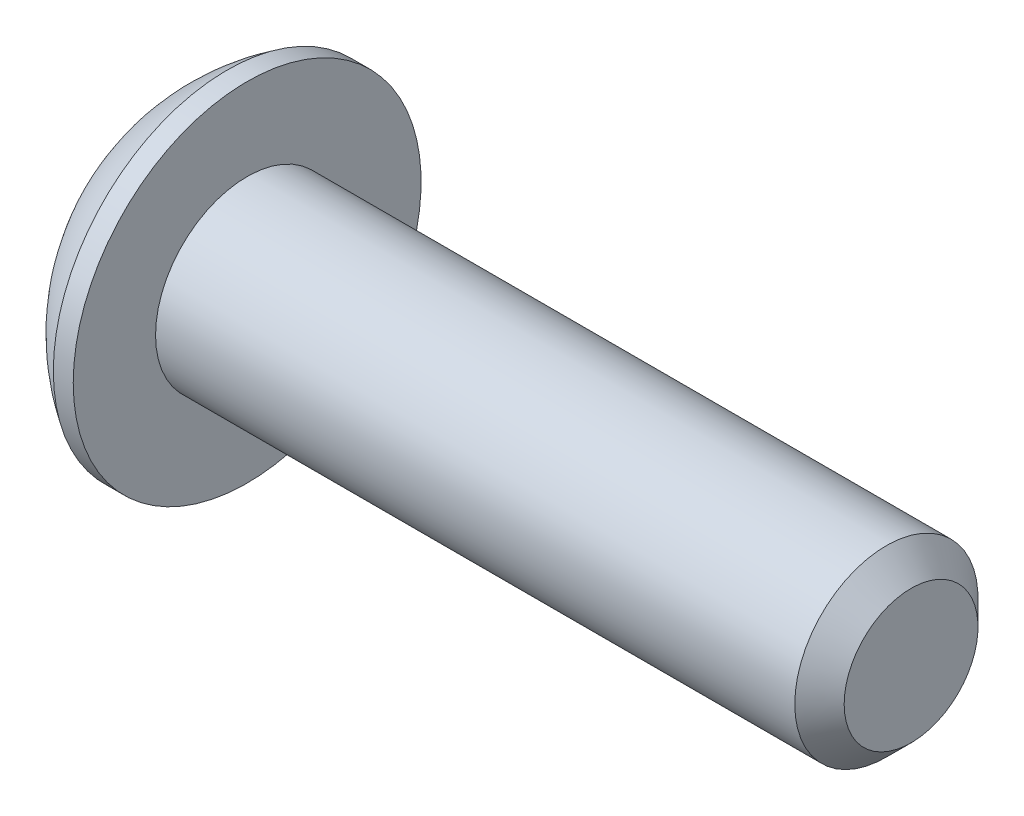
ISO-10303-21;
HEADER;
FILE_DESCRIPTION(('STEP AP214'),'2;1');
FILE_NAME('part.step','',(''),(''),'','','');
FILE_SCHEMA(('AUTOMOTIVE_DESIGN { 1 0 10303 214 1 1 1 1 }'));
ENDSEC;
DATA;
#1=APPLICATION_CONTEXT('core data for automotive mechanical design processes');
#2=APPLICATION_PROTOCOL_DEFINITION('international standard','automotive_design',2000,#1);
#3=PRODUCT_CONTEXT('',#1,'mechanical');
#4=PRODUCT('Part','Part','',(#3));
#5=PRODUCT_RELATED_PRODUCT_CATEGORY('part','',(#4));
#6=PRODUCT_DEFINITION_FORMATION('','',#4);
#7=PRODUCT_DEFINITION_CONTEXT('part definition',#1,'design');
#8=PRODUCT_DEFINITION('design','',#6,#7);
#9=PRODUCT_DEFINITION_SHAPE('','',#8);
#10=(LENGTH_UNIT() NAMED_UNIT(*) SI_UNIT(.MILLI.,.METRE.));
#11=(NAMED_UNIT(*) PLANE_ANGLE_UNIT() SI_UNIT($,.RADIAN.));
#12=(NAMED_UNIT(*) SI_UNIT($,.STERADIAN.) SOLID_ANGLE_UNIT());
#13=UNCERTAINTY_MEASURE_WITH_UNIT(LENGTH_MEASURE(1.E-05),#10,'distance_accuracy_value','');
#14=(GEOMETRIC_REPRESENTATION_CONTEXT(3) GLOBAL_UNCERTAINTY_ASSIGNED_CONTEXT((#13)) GLOBAL_UNIT_ASSIGNED_CONTEXT((#10,
#11,#12)) REPRESENTATION_CONTEXT('',''));
#15=CARTESIAN_POINT('',(0.,0.,0.));
#16=DIRECTION('',(0.,0.,1.));
#17=DIRECTION('',(1.,0.,0.));
#18=AXIS2_PLACEMENT_3D('',#15,#16,#17);
#19=CARTESIAN_POINT('',(0.,0.,0.));
#20=DIRECTION('',(-1.,0.,0.));
#21=DIRECTION('',(0.,0.,1.));
#22=AXIS2_PLACEMENT_3D('',#19,#20,#21);
#23=PLANE('',#22);
#24=CARTESIAN_POINT('',(0.,0.,0.));
#25=DIRECTION('',(-1.,0.,0.));
#26=DIRECTION('',(0.,0.,1.));
#27=AXIS2_PLACEMENT_3D('',#24,#25,#26);
#28=CIRCLE('',#27,1.6637);
#29=CARTESIAN_POINT('',(0.,0.,1.6637));
#30=VERTEX_POINT('',#29);
#31=EDGE_CURVE('E11',#30,#30,#28,.T.);
#32=ORIENTED_EDGE('',*,*,#31,.T.);
#33=EDGE_LOOP('',(#32));
#34=FACE_BOUND('',#33,.T.);
#35=DIRECTION('',(0.,-1.,0.));
#36=VECTOR('',#35,1.);
#37=CARTESIAN_POINT('',(0.,-0.571923176659242,0.9906));
#38=LINE('',#37,#36);
#39=CARTESIAN_POINT('',(0.,0.571923176659244,0.9906));
#40=VERTEX_POINT('',#39);
#41=CARTESIAN_POINT('',(0.,-0.571923176659242,0.9906));
#42=VERTEX_POINT('',#41);
#43=EDGE_CURVE('E44',#40,#42,#38,.T.);
#44=ORIENTED_EDGE('',*,*,#43,.T.);
#45=DIRECTION('',(0.,-0.5,-0.866025403784439));
#46=VECTOR('',#45,1.);
#47=CARTESIAN_POINT('',(0.,-1.14384635331849,0.));
#48=LINE('',#47,#46);
#49=CARTESIAN_POINT('',(0.,-1.14384635331849,0.));
#50=VERTEX_POINT('',#49);
#51=EDGE_CURVE('E365',#42,#50,#48,.T.);
#52=ORIENTED_EDGE('',*,*,#51,.T.);
#53=DIRECTION('',(0.,0.5,-0.866025403784439));
#54=VECTOR('',#53,1.);
#55=CARTESIAN_POINT('',(0.,-0.571923176659242,-0.9906));
#56=LINE('',#55,#54);
#57=CARTESIAN_POINT('',(0.,-0.571923176659242,-0.9906));
#58=VERTEX_POINT('',#57);
#59=EDGE_CURVE('E129',#50,#58,#56,.T.);
#60=ORIENTED_EDGE('',*,*,#59,.T.);
#61=DIRECTION('',(0.,1.,0.));
#62=VECTOR('',#61,1.);
#63=CARTESIAN_POINT('',(0.,0.571923176659244,-0.9906));
#64=LINE('',#63,#62);
#65=CARTESIAN_POINT('',(0.,0.571923176659244,-0.9906));
#66=VERTEX_POINT('',#65);
#67=EDGE_CURVE('E368',#58,#66,#64,.T.);
#68=ORIENTED_EDGE('',*,*,#67,.T.);
#69=DIRECTION('',(0.,0.5,0.866025403784439));
#70=VECTOR('',#69,1.);
#71=CARTESIAN_POINT('',(0.,1.14384635331849,0.));
#72=LINE('',#71,#70);
#73=CARTESIAN_POINT('',(0.,1.14384635331849,0.));
#74=VERTEX_POINT('',#73);
#75=EDGE_CURVE('E370',#66,#74,#72,.T.);
#76=ORIENTED_EDGE('',*,*,#75,.T.);
#77=DIRECTION('',(0.,-0.5,0.866025403784439));
#78=VECTOR('',#77,1.);
#79=CARTESIAN_POINT('',(0.,0.571923176659244,0.9906));
#80=LINE('',#79,#78);
#81=EDGE_CURVE('E372',#74,#40,#80,.T.);
#82=ORIENTED_EDGE('',*,*,#81,.T.);
#83=EDGE_LOOP('',(#44,#52,#60,#68,#76,#82));
#84=FACE_BOUND('',#83,.T.);
#85=ADVANCED_FACE('F30',(#34,#84),#23,.T.);
#86=CARTESIAN_POINT('',(3.55485043103449,0.,0.));
#87=DIRECTION('',(-1.,0.,0.));
#88=DIRECTION('',(0.,1.,0.));
#89=AXIS2_PLACEMENT_3D('',#86,#87,#88);
#90=SPHERICAL_SURFACE('',#89,3.92490245445999);
#91=CARTESIAN_POINT('',(1.4732,0.,0.));
#92=DIRECTION('',(-1.,0.,0.));
#93=DIRECTION('',(0.,0.,1.));
#94=AXIS2_PLACEMENT_3D('',#91,#92,#93);
#95=CIRCLE('',#94,3.3274);
#96=CARTESIAN_POINT('',(1.4732,0.,3.3274));
#97=VERTEX_POINT('',#96);
#98=EDGE_CURVE('E37',#97,#97,#95,.T.);
#99=ORIENTED_EDGE('',*,*,#98,.T.);
#100=EDGE_LOOP('',(#99));
#101=FACE_BOUND('',#100,.T.);
#102=ORIENTED_EDGE('',*,*,#31,.F.);
#103=EDGE_LOOP('',(#102));
#104=FACE_BOUND('',#103,.T.);
#105=ADVANCED_FACE('F156',(#101,#104),#90,.T.);
#106=CARTESIAN_POINT('',(0.,0.,0.));
#107=DIRECTION('',(-1.,0.,0.));
#108=DIRECTION('',(0.,0.,1.));
#109=AXIS2_PLACEMENT_3D('',#106,#107,#108);
#110=CYLINDRICAL_SURFACE('',#109,3.3274);
#111=ORIENTED_EDGE('',*,*,#98,.F.);
#112=EDGE_LOOP('',(#111));
#113=FACE_BOUND('',#112,.T.);
#114=CARTESIAN_POINT('',(1.8542,0.,0.));
#115=DIRECTION('',(-1.,0.,0.));
#116=DIRECTION('',(0.,0.,1.));
#117=AXIS2_PLACEMENT_3D('',#114,#115,#116);
#118=CIRCLE('',#117,3.3274);
#119=CARTESIAN_POINT('',(1.8542,0.,3.3274));
#120=VERTEX_POINT('',#119);
#121=EDGE_CURVE('E151',#120,#120,#118,.T.);
#122=ORIENTED_EDGE('',*,*,#121,.T.);
#123=EDGE_LOOP('',(#122));
#124=FACE_BOUND('',#123,.T.);
#125=ADVANCED_FACE('F159',(#113,#124),#110,.T.);
#126=CARTESIAN_POINT('',(1.8542,1.7526,0.));
#127=DIRECTION('',(-1.,0.,0.));
#128=DIRECTION('',(0.,0.,1.));
#129=AXIS2_PLACEMENT_3D('',#126,#127,#128);
#130=PLANE('',#129);
#131=ORIENTED_EDGE('',*,*,#121,.F.);
#132=EDGE_LOOP('',(#131));
#133=FACE_BOUND('',#132,.T.);
#134=CARTESIAN_POINT('',(1.8542,0.,0.));
#135=DIRECTION('',(-1.,0.,0.));
#136=DIRECTION('',(0.,0.,1.));
#137=AXIS2_PLACEMENT_3D('',#134,#135,#136);
#138=CIRCLE('',#137,1.7526);
#139=CARTESIAN_POINT('',(1.8542,0.,1.7526));
#140=VERTEX_POINT('',#139);
#141=EDGE_CURVE('E148',#140,#140,#138,.T.);
#142=ORIENTED_EDGE('',*,*,#141,.T.);
#143=EDGE_LOOP('',(#142));
#144=FACE_BOUND('',#143,.T.);
#145=ADVANCED_FACE('F162',(#133,#144),#130,.F.);
#146=CARTESIAN_POINT('',(0.,0.,0.));
#147=DIRECTION('',(-1.,0.,0.));
#148=DIRECTION('',(0.,0.,1.));
#149=AXIS2_PLACEMENT_3D('',#146,#147,#148);
#150=CYLINDRICAL_SURFACE('',#149,1.7526);
#151=ORIENTED_EDGE('',*,*,#141,.F.);
#152=EDGE_LOOP('',(#151));
#153=FACE_BOUND('',#152,.T.);
#154=CARTESIAN_POINT('',(14.08176,0.,0.));
#155=DIRECTION('',(-1.,0.,0.));
#156=DIRECTION('',(0.,0.,1.));
#157=AXIS2_PLACEMENT_3D('',#154,#155,#156);
#158=CIRCLE('',#157,1.7526);
#159=CARTESIAN_POINT('',(14.08176,0.,1.7526));
#160=VERTEX_POINT('',#159);
#161=EDGE_CURVE('E145',#160,#160,#158,.T.);
#162=ORIENTED_EDGE('',*,*,#161,.T.);
#163=EDGE_LOOP('',(#162));
#164=FACE_BOUND('',#163,.T.);
#165=ADVANCED_FACE('F168',(#153,#164),#150,.T.);
#166=CARTESIAN_POINT('',(14.5542,0.,0.));
#167=DIRECTION('',(-1.,0.,0.));
#168=DIRECTION('',(0.,0.,1.));
#169=AXIS2_PLACEMENT_3D('',#166,#167,#168);
#170=CONICAL_SURFACE('',#169,1.28016,0.785398163397441);
#171=ORIENTED_EDGE('',*,*,#161,.F.);
#172=EDGE_LOOP('',(#171));
#173=FACE_BOUND('',#172,.T.);
#174=CARTESIAN_POINT('',(14.5542,0.,0.));
#175=DIRECTION('',(-1.,0.,0.));
#176=DIRECTION('',(0.,0.,1.));
#177=AXIS2_PLACEMENT_3D('',#174,#175,#176);
#178=CIRCLE('',#177,1.28016);
#179=CARTESIAN_POINT('',(14.5542,0.,1.28016));
#180=VERTEX_POINT('',#179);
#181=EDGE_CURVE('E141',#180,#180,#178,.T.);
#182=ORIENTED_EDGE('',*,*,#181,.T.);
#183=EDGE_LOOP('',(#182));
#184=FACE_BOUND('',#183,.T.);
#185=ADVANCED_FACE('F174',(#173,#184),#170,.T.);
#186=CARTESIAN_POINT('',(14.5542,0.,0.));
#187=DIRECTION('',(-1.,0.,0.));
#188=DIRECTION('',(0.,0.,1.));
#189=AXIS2_PLACEMENT_3D('',#186,#187,#188);
#190=PLANE('',#189);
#191=ORIENTED_EDGE('',*,*,#181,.F.);
#192=EDGE_LOOP('',(#191));
#193=FACE_BOUND('',#192,.T.);
#194=ADVANCED_FACE('F180',(#193),#190,.F.);
#195=CARTESIAN_POINT('',(1.1176,-1.14384635331849,0.));
#196=DIRECTION('',(0.,0.866025403784439,-0.5));
#197=DIRECTION('',(0.,0.5,0.866025403784439));
#198=AXIS2_PLACEMENT_3D('',#195,#196,#197);
#199=PLANE('',#198);
#200=DIRECTION('',(0.,-0.5,-0.866025403784439));
#201=VECTOR('',#200,1.);
#202=CARTESIAN_POINT('',(1.1176,-1.14384635331849,0.));
#203=LINE('',#202,#201);
#204=CARTESIAN_POINT('',(1.1176,-0.571923176659242,0.9906));
#205=VERTEX_POINT('',#204);
#206=CARTESIAN_POINT('',(1.1176,-0.857884764988864,0.495299999999999));
#207=VERTEX_POINT('',#206);
#208=EDGE_CURVE('E112',#205,#207,#203,.T.);
#209=ORIENTED_EDGE('',*,*,#208,.T.);
#210=CARTESIAN_POINT('',(1.1176,-1.14384635331849,0.));
#211=VERTEX_POINT('',#210);
#212=EDGE_CURVE('E105',#207,#211,#203,.T.);
#213=ORIENTED_EDGE('',*,*,#212,.T.);
#214=DIRECTION('',(-1.,0.,0.));
#215=VECTOR('',#214,1.);
#216=CARTESIAN_POINT('',(1.1176,-1.14384635331849,0.));
#217=LINE('',#216,#215);
#218=EDGE_CURVE('E109',#211,#50,#217,.T.);
#219=ORIENTED_EDGE('',*,*,#218,.T.);
#220=ORIENTED_EDGE('',*,*,#51,.F.);
#221=DIRECTION('',(-1.,0.,0.));
#222=VECTOR('',#221,1.);
#223=CARTESIAN_POINT('',(1.1176,-0.571923176659242,0.9906));
#224=LINE('',#223,#222);
#225=EDGE_CURVE('E364',#205,#42,#224,.T.);
#226=ORIENTED_EDGE('',*,*,#225,.F.);
#227=EDGE_LOOP('',(#209,#213,#219,#220,#226));
#228=FACE_BOUND('',#227,.T.);
#229=ADVANCED_FACE('F107',(#228),#199,.T.);
#230=CARTESIAN_POINT('',(1.1176,-0.571923176659242,-0.9906));
#231=DIRECTION('',(0.,0.866025403784439,0.5));
#232=DIRECTION('',(0.,-0.5,0.866025403784439));
#233=AXIS2_PLACEMENT_3D('',#230,#231,#232);
#234=PLANE('',#233);
#235=DIRECTION('',(0.,0.5,-0.866025403784439));
#236=VECTOR('',#235,1.);
#237=CARTESIAN_POINT('',(1.1176,-0.571923176659242,-0.9906));
#238=LINE('',#237,#236);
#239=CARTESIAN_POINT('',(1.1176,-0.857884764988864,-0.495299999999999));
#240=VERTEX_POINT('',#239);
#241=EDGE_CURVE('E117',#211,#240,#238,.T.);
#242=ORIENTED_EDGE('',*,*,#241,.T.);
#243=CARTESIAN_POINT('',(1.1176,-0.571923176659242,-0.9906));
#244=VERTEX_POINT('',#243);
#245=EDGE_CURVE('E124',#240,#244,#238,.T.);
#246=ORIENTED_EDGE('',*,*,#245,.T.);
#247=DIRECTION('',(-1.,0.,0.));
#248=VECTOR('',#247,1.);
#249=CARTESIAN_POINT('',(1.1176,-0.571923176659242,-0.9906));
#250=LINE('',#249,#248);
#251=EDGE_CURVE('E131',#244,#58,#250,.T.);
#252=ORIENTED_EDGE('',*,*,#251,.T.);
#253=ORIENTED_EDGE('',*,*,#59,.F.);
#254=ORIENTED_EDGE('',*,*,#218,.F.);
#255=EDGE_LOOP('',(#242,#246,#252,#253,#254));
#256=FACE_BOUND('',#255,.T.);
#257=ADVANCED_FACE('F127',(#256),#234,.T.);
#258=CARTESIAN_POINT('',(1.1176,0.571923176659244,-0.9906));
#259=DIRECTION('',(0.,0.,1.));
#260=DIRECTION('',(1.,0.,0.));
#261=AXIS2_PLACEMENT_3D('',#258,#259,#260);
#262=PLANE('',#261);
#263=DIRECTION('',(0.,1.,0.));
#264=VECTOR('',#263,1.);
#265=CARTESIAN_POINT('',(1.1176,0.571923176659244,-0.9906));
#266=LINE('',#265,#264);
#267=CARTESIAN_POINT('',(1.1176,0.,-0.9906));
#268=VERTEX_POINT('',#267);
#269=EDGE_CURVE('E389',#244,#268,#266,.T.);
#270=ORIENTED_EDGE('',*,*,#269,.T.);
#271=CARTESIAN_POINT('',(1.1176,0.571923176659244,-0.9906));
#272=VERTEX_POINT('',#271);
#273=EDGE_CURVE('E123',#268,#272,#266,.T.);
#274=ORIENTED_EDGE('',*,*,#273,.T.);
#275=DIRECTION('',(-1.,0.,0.));
#276=VECTOR('',#275,1.);
#277=CARTESIAN_POINT('',(1.1176,0.571923176659244,-0.9906));
#278=LINE('',#277,#276);
#279=EDGE_CURVE('E136',#272,#66,#278,.T.);
#280=ORIENTED_EDGE('',*,*,#279,.T.);
#281=ORIENTED_EDGE('',*,*,#67,.F.);
#282=ORIENTED_EDGE('',*,*,#251,.F.);
#283=EDGE_LOOP('',(#270,#274,#280,#281,#282));
#284=FACE_BOUND('',#283,.T.);
#285=ADVANCED_FACE('F239',(#284),#262,.T.);
#286=CARTESIAN_POINT('',(1.1176,1.14384635331849,0.));
#287=DIRECTION('',(0.,-0.866025403784439,0.5));
#288=DIRECTION('',(0.,-0.5,-0.866025403784439));
#289=AXIS2_PLACEMENT_3D('',#286,#287,#288);
#290=PLANE('',#289);
#291=DIRECTION('',(0.,0.5,0.866025403784439));
#292=VECTOR('',#291,1.);
#293=CARTESIAN_POINT('',(1.1176,1.14384635331849,0.));
#294=LINE('',#293,#292);
#295=CARTESIAN_POINT('',(1.1176,0.857884764988865,-0.495300000000001));
#296=VERTEX_POINT('',#295);
#297=EDGE_CURVE('E351',#272,#296,#294,.T.);
#298=ORIENTED_EDGE('',*,*,#297,.T.);
#299=CARTESIAN_POINT('',(1.1176,1.14384635331849,0.));
#300=VERTEX_POINT('',#299);
#301=EDGE_CURVE('E391',#296,#300,#294,.T.);
#302=ORIENTED_EDGE('',*,*,#301,.T.);
#303=DIRECTION('',(-1.,0.,0.));
#304=VECTOR('',#303,1.);
#305=CARTESIAN_POINT('',(1.1176,1.14384635331849,0.));
#306=LINE('',#305,#304);
#307=EDGE_CURVE('E357',#300,#74,#306,.T.);
#308=ORIENTED_EDGE('',*,*,#307,.T.);
#309=ORIENTED_EDGE('',*,*,#75,.F.);
#310=ORIENTED_EDGE('',*,*,#279,.F.);
#311=EDGE_LOOP('',(#298,#302,#308,#309,#310));
#312=FACE_BOUND('',#311,.T.);
#313=ADVANCED_FACE('F248',(#312),#290,.T.);
#314=CARTESIAN_POINT('',(1.1176,0.571923176659244,0.9906));
#315=DIRECTION('',(0.,-0.866025403784439,-0.5));
#316=DIRECTION('',(0.,0.5,-0.866025403784439));
#317=AXIS2_PLACEMENT_3D('',#314,#315,#316);
#318=PLANE('',#317);
#319=DIRECTION('',(0.,-0.5,0.866025403784439));
#320=VECTOR('',#319,1.);
#321=CARTESIAN_POINT('',(1.1176,0.571923176659244,0.9906));
#322=LINE('',#321,#320);
#323=CARTESIAN_POINT('',(1.1176,0.857884764988865,0.4953));
#324=VERTEX_POINT('',#323);
#325=EDGE_CURVE('E350',#300,#324,#322,.T.);
#326=ORIENTED_EDGE('',*,*,#325,.T.);
#327=CARTESIAN_POINT('',(1.1176,0.571923176659244,0.9906));
#328=VERTEX_POINT('',#327);
#329=EDGE_CURVE('E347',#324,#328,#322,.T.);
#330=ORIENTED_EDGE('',*,*,#329,.T.);
#331=DIRECTION('',(-1.,0.,0.));
#332=VECTOR('',#331,1.);
#333=CARTESIAN_POINT('',(1.1176,0.571923176659244,0.9906));
#334=LINE('',#333,#332);
#335=EDGE_CURVE('E377',#328,#40,#334,.T.);
#336=ORIENTED_EDGE('',*,*,#335,.T.);
#337=ORIENTED_EDGE('',*,*,#81,.F.);
#338=ORIENTED_EDGE('',*,*,#307,.F.);
#339=EDGE_LOOP('',(#326,#330,#336,#337,#338));
#340=FACE_BOUND('',#339,.T.);
#341=ADVANCED_FACE('F258',(#340),#318,.T.);
#342=CARTESIAN_POINT('',(1.1176,-0.571923176659242,0.9906));
#343=DIRECTION('',(0.,0.,-1.));
#344=DIRECTION('',(-1.,0.,0.));
#345=AXIS2_PLACEMENT_3D('',#342,#343,#344);
#346=PLANE('',#345);
#347=DIRECTION('',(0.,-1.,0.));
#348=VECTOR('',#347,1.);
#349=CARTESIAN_POINT('',(1.1176,-0.571923176659242,0.9906));
#350=LINE('',#349,#348);
#351=CARTESIAN_POINT('',(1.1176,0.,0.9906));
#352=VERTEX_POINT('',#351);
#353=EDGE_CURVE('E52',#328,#352,#350,.T.);
#354=ORIENTED_EDGE('',*,*,#353,.T.);
#355=EDGE_CURVE('E359',#352,#205,#350,.T.);
#356=ORIENTED_EDGE('',*,*,#355,.T.);
#357=ORIENTED_EDGE('',*,*,#225,.T.);
#358=ORIENTED_EDGE('',*,*,#43,.F.);
#359=ORIENTED_EDGE('',*,*,#335,.F.);
#360=EDGE_LOOP('',(#354,#356,#357,#358,#359));
#361=FACE_BOUND('',#360,.T.);
#362=ADVANCED_FACE('F268',(#361),#346,.T.);
#363=CARTESIAN_POINT('',(1.1176,-0.571923176659242,0.9906));
#364=DIRECTION('',(-1.,0.,0.));
#365=DIRECTION('',(0.,0.,1.));
#366=AXIS2_PLACEMENT_3D('',#363,#364,#365);
#367=PLANE('',#366);
#368=ORIENTED_EDGE('',*,*,#353,.F.);
#369=ORIENTED_EDGE('',*,*,#329,.F.);
#370=CARTESIAN_POINT('',(1.1176,0.,0.));
#371=DIRECTION('',(-1.,0.,0.));
#372=DIRECTION('',(0.,0.,1.));
#373=AXIS2_PLACEMENT_3D('',#370,#371,#372);
#374=CIRCLE('',#373,0.9906);
#375=EDGE_CURVE('E135',#352,#324,#374,.T.);
#376=ORIENTED_EDGE('',*,*,#375,.F.);
#377=EDGE_LOOP('',(#368,#369,#376));
#378=FACE_BOUND('',#377,.T.);
#379=ADVANCED_FACE('F278',(#378),#367,.T.);
#380=ORIENTED_EDGE('',*,*,#325,.F.);
#381=ORIENTED_EDGE('',*,*,#301,.F.);
#382=EDGE_CURVE('E142',#324,#296,#374,.T.);
#383=ORIENTED_EDGE('',*,*,#382,.F.);
#384=EDGE_LOOP('',(#380,#381,#383));
#385=FACE_BOUND('',#384,.T.);
#386=ADVANCED_FACE('F287',(#385),#367,.T.);
#387=ORIENTED_EDGE('',*,*,#297,.F.);
#388=ORIENTED_EDGE('',*,*,#273,.F.);
#389=EDGE_CURVE('E392',#296,#268,#374,.T.);
#390=ORIENTED_EDGE('',*,*,#389,.F.);
#391=EDGE_LOOP('',(#387,#388,#390));
#392=FACE_BOUND('',#391,.T.);
#393=ADVANCED_FACE('F298',(#392),#367,.T.);
#394=ORIENTED_EDGE('',*,*,#269,.F.);
#395=ORIENTED_EDGE('',*,*,#245,.F.);
#396=EDGE_CURVE('E390',#268,#240,#374,.T.);
#397=ORIENTED_EDGE('',*,*,#396,.F.);
#398=EDGE_LOOP('',(#394,#395,#397));
#399=FACE_BOUND('',#398,.T.);
#400=ADVANCED_FACE('F307',(#399),#367,.T.);
#401=ORIENTED_EDGE('',*,*,#241,.F.);
#402=ORIENTED_EDGE('',*,*,#212,.F.);
#403=EDGE_CURVE('E119',#240,#207,#374,.T.);
#404=ORIENTED_EDGE('',*,*,#403,.F.);
#405=EDGE_LOOP('',(#401,#402,#404));
#406=FACE_BOUND('',#405,.T.);
#407=ADVANCED_FACE('F118',(#406),#367,.T.);
#408=ORIENTED_EDGE('',*,*,#208,.F.);
#409=ORIENTED_EDGE('',*,*,#355,.F.);
#410=EDGE_CURVE('E130',#207,#352,#374,.T.);
#411=ORIENTED_EDGE('',*,*,#410,.F.);
#412=EDGE_LOOP('',(#408,#409,#411));
#413=FACE_BOUND('',#412,.T.);
#414=ADVANCED_FACE('F290',(#413),#367,.T.);
#415=CARTESIAN_POINT('',(1.68952317665925,0.,0.));
#416=DIRECTION('',(-1.,0.,0.));
#417=DIRECTION('',(0.,0.,1.));
#418=AXIS2_PLACEMENT_3D('',#415,#416,#417);
#419=CONICAL_SURFACE('',#418,0.,1.04719755119659);
#420=ORIENTED_EDGE('',*,*,#375,.T.);
#421=ORIENTED_EDGE('',*,*,#382,.T.);
#422=ORIENTED_EDGE('',*,*,#389,.T.);
#423=ORIENTED_EDGE('',*,*,#396,.T.);
#424=ORIENTED_EDGE('',*,*,#403,.T.);
#425=ORIENTED_EDGE('',*,*,#410,.T.);
#426=EDGE_LOOP('',(#420,#421,#422,#423,#424,#425));
#427=FACE_BOUND('',#426,.T.);
#428=CARTESIAN_POINT('',(1.68952317665925,0.,0.));
#429=VERTEX_POINT('',#428);
#430=VERTEX_LOOP('',#429);
#431=FACE_BOUND('',#430,.T.);
#432=ADVANCED_FACE('F331',(#427,#431),#419,.F.);
#433=CLOSED_SHELL('',(#85,#105,#125,#145,#165,#185,#194,#229,#257,#285,#313,#341,#362,#379,#386,
#393,#400,#407,#414,#432));
#434=MANIFOLD_SOLID_BREP('B2',#433);
#435=ADVANCED_BREP_SHAPE_REPRESENTATION('',(#18,#434),#14);
#436=SHAPE_DEFINITION_REPRESENTATION(#9,#435);
ENDSEC;
END-ISO-10303-21;
